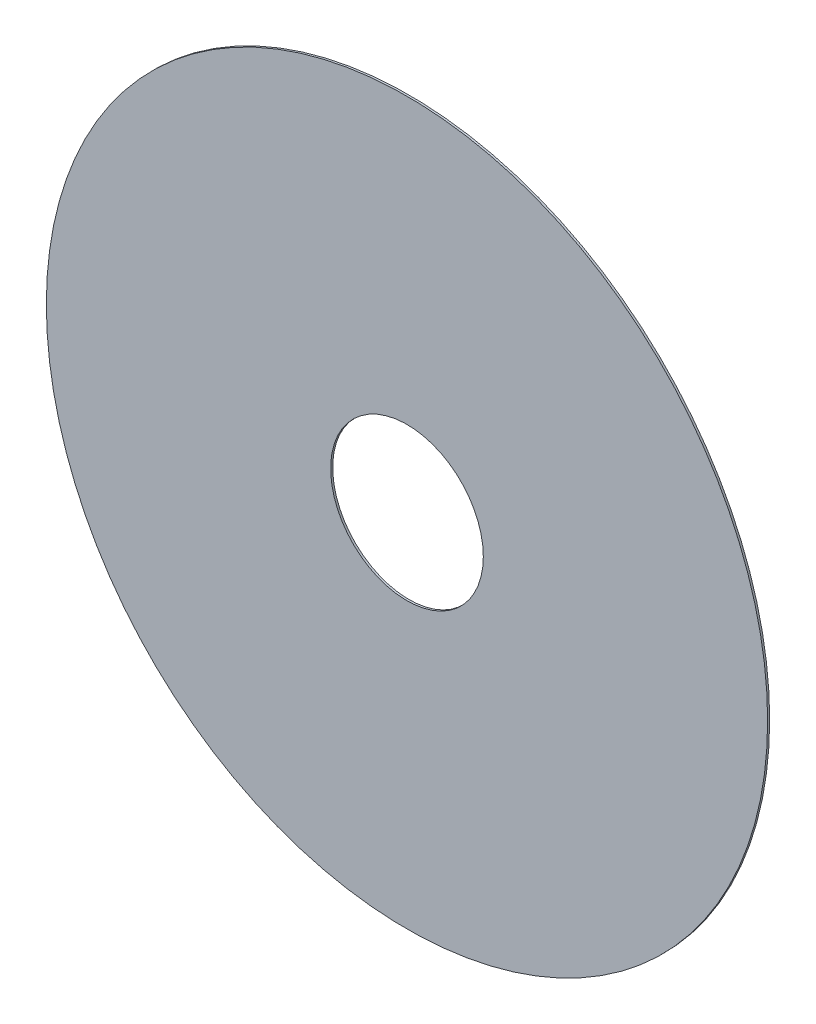
ISO-10303-21;
HEADER;
FILE_DESCRIPTION(('STEP AP214'),'2;1');
FILE_NAME('part.step','',(''),(''),'','','');
FILE_SCHEMA(('AUTOMOTIVE_DESIGN { 1 0 10303 214 1 1 1 1 }'));
ENDSEC;
DATA;
#1=APPLICATION_CONTEXT('core data for automotive mechanical design processes');
#2=APPLICATION_PROTOCOL_DEFINITION('international standard','automotive_design',2000,#1);
#3=PRODUCT_CONTEXT('',#1,'mechanical');
#4=PRODUCT('Part','Part','',(#3));
#5=PRODUCT_RELATED_PRODUCT_CATEGORY('part','',(#4));
#6=PRODUCT_DEFINITION_FORMATION('','',#4);
#7=PRODUCT_DEFINITION_CONTEXT('part definition',#1,'design');
#8=PRODUCT_DEFINITION('design','',#6,#7);
#9=PRODUCT_DEFINITION_SHAPE('','',#8);
#10=(LENGTH_UNIT() NAMED_UNIT(*) SI_UNIT(.MILLI.,.METRE.));
#11=(NAMED_UNIT(*) PLANE_ANGLE_UNIT() SI_UNIT($,.RADIAN.));
#12=(NAMED_UNIT(*) SI_UNIT($,.STERADIAN.) SOLID_ANGLE_UNIT());
#13=UNCERTAINTY_MEASURE_WITH_UNIT(LENGTH_MEASURE(1.E-05),#10,'distance_accuracy_value','');
#14=(GEOMETRIC_REPRESENTATION_CONTEXT(3) GLOBAL_UNCERTAINTY_ASSIGNED_CONTEXT((#13)) GLOBAL_UNIT_ASSIGNED_CONTEXT((#10,
#11,#12)) REPRESENTATION_CONTEXT('',''));
#15=CARTESIAN_POINT('',(0.,0.,0.));
#16=DIRECTION('',(0.,0.,1.));
#17=DIRECTION('',(1.,0.,0.));
#18=AXIS2_PLACEMENT_3D('',#15,#16,#17);
#19=CARTESIAN_POINT('',(0.,0.,0.1016));
#20=DIRECTION('',(0.,0.,1.));
#21=DIRECTION('',(1.,0.,0.));
#22=AXIS2_PLACEMENT_3D('',#19,#20,#21);
#23=PLANE('',#22);
#24=CARTESIAN_POINT('',(0.,0.,0.1016));
#25=DIRECTION('',(0.,0.,1.));
#26=DIRECTION('',(1.,0.,0.));
#27=AXIS2_PLACEMENT_3D('',#24,#25,#26);
#28=CIRCLE('',#27,18.);
#29=CARTESIAN_POINT('',(18.,0.,0.1016));
#30=VERTEX_POINT('',#29);
#31=EDGE_CURVE('E10',#30,#30,#28,.T.);
#32=ORIENTED_EDGE('',*,*,#31,.T.);
#33=EDGE_LOOP('',(#32));
#34=FACE_BOUND('',#33,.T.);
#35=CARTESIAN_POINT('',(0.,0.,0.1016));
#36=DIRECTION('',(0.,0.,1.));
#37=DIRECTION('',(1.,0.,0.));
#38=AXIS2_PLACEMENT_3D('',#35,#36,#37);
#39=CIRCLE('',#38,3.81);
#40=CARTESIAN_POINT('',(3.81,0.,0.1016));
#41=VERTEX_POINT('',#40);
#42=EDGE_CURVE('E45',#41,#41,#39,.T.);
#43=ORIENTED_EDGE('',*,*,#42,.F.);
#44=EDGE_LOOP('',(#43));
#45=FACE_BOUND('',#44,.T.);
#46=ADVANCED_FACE('F34',(#34,#45),#23,.T.);
#47=CARTESIAN_POINT('',(0.,0.,0.));
#48=DIRECTION('',(0.,0.,1.));
#49=DIRECTION('',(1.,0.,0.));
#50=AXIS2_PLACEMENT_3D('',#47,#48,#49);
#51=PLANE('',#50);
#52=CARTESIAN_POINT('',(0.,0.,0.));
#53=DIRECTION('',(0.,0.,1.));
#54=DIRECTION('',(1.,0.,0.));
#55=AXIS2_PLACEMENT_3D('',#52,#53,#54);
#56=CIRCLE('',#55,18.);
#57=CARTESIAN_POINT('',(18.,0.,0.));
#58=VERTEX_POINT('',#57);
#59=EDGE_CURVE('E38',#58,#58,#56,.T.);
#60=ORIENTED_EDGE('',*,*,#59,.F.);
#61=EDGE_LOOP('',(#60));
#62=FACE_BOUND('',#61,.T.);
#63=CARTESIAN_POINT('',(0.,0.,0.));
#64=DIRECTION('',(0.,0.,1.));
#65=DIRECTION('',(1.,0.,0.));
#66=AXIS2_PLACEMENT_3D('',#63,#64,#65);
#67=CIRCLE('',#66,3.81);
#68=CARTESIAN_POINT('',(3.81,0.,0.));
#69=VERTEX_POINT('',#68);
#70=EDGE_CURVE('E47',#69,#69,#67,.T.);
#71=ORIENTED_EDGE('',*,*,#70,.T.);
#72=EDGE_LOOP('',(#71));
#73=FACE_BOUND('',#72,.T.);
#74=ADVANCED_FACE('F57',(#62,#73),#51,.F.);
#75=CARTESIAN_POINT('',(0.,0.,0.1016));
#76=DIRECTION('',(0.,0.,-1.));
#77=DIRECTION('',(-1.,0.,0.));
#78=AXIS2_PLACEMENT_3D('',#75,#76,#77);
#79=CYLINDRICAL_SURFACE('',#78,18.);
#80=ORIENTED_EDGE('',*,*,#31,.F.);
#81=EDGE_LOOP('',(#80));
#82=FACE_BOUND('',#81,.T.);
#83=ORIENTED_EDGE('',*,*,#59,.T.);
#84=EDGE_LOOP('',(#83));
#85=FACE_BOUND('',#84,.T.);
#86=ADVANCED_FACE('F36',(#82,#85),#79,.T.);
#87=CARTESIAN_POINT('',(0.,0.,0.1016));
#88=DIRECTION('',(0.,0.,-1.));
#89=DIRECTION('',(-1.,0.,0.));
#90=AXIS2_PLACEMENT_3D('',#87,#88,#89);
#91=CYLINDRICAL_SURFACE('',#90,3.81);
#92=ORIENTED_EDGE('',*,*,#42,.T.);
#93=EDGE_LOOP('',(#92));
#94=FACE_BOUND('',#93,.T.);
#95=ORIENTED_EDGE('',*,*,#70,.F.);
#96=EDGE_LOOP('',(#95));
#97=FACE_BOUND('',#96,.T.);
#98=ADVANCED_FACE('F53',(#94,#97),#91,.F.);
#99=CLOSED_SHELL('',(#46,#74,#86,#98));
#100=MANIFOLD_SOLID_BREP('B2',#99);
#101=ADVANCED_BREP_SHAPE_REPRESENTATION('',(#18,#100),#14);
#102=SHAPE_DEFINITION_REPRESENTATION(#9,#101);
ENDSEC;
END-ISO-10303-21;
